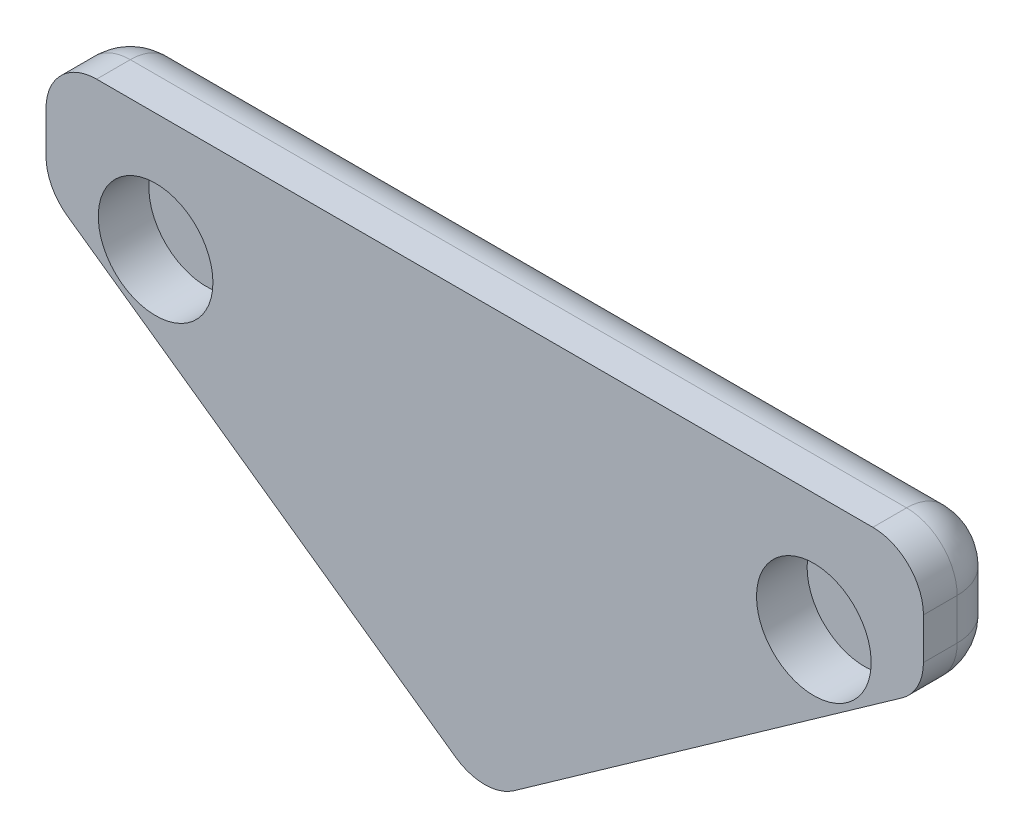
ISO-10303-21;
HEADER;
FILE_DESCRIPTION(('STEP AP214'),'2;1');
FILE_NAME('part.step','',(''),(''),'','','');
FILE_SCHEMA(('AUTOMOTIVE_DESIGN { 1 0 10303 214 1 1 1 1 }'));
ENDSEC;
DATA;
#1=APPLICATION_CONTEXT('core data for automotive mechanical design processes');
#2=APPLICATION_PROTOCOL_DEFINITION('international standard','automotive_design',2000,#1);
#3=PRODUCT_CONTEXT('',#1,'mechanical');
#4=PRODUCT('Part','Part','',(#3));
#5=PRODUCT_RELATED_PRODUCT_CATEGORY('part','',(#4));
#6=PRODUCT_DEFINITION_FORMATION('','',#4);
#7=PRODUCT_DEFINITION_CONTEXT('part definition',#1,'design');
#8=PRODUCT_DEFINITION('design','',#6,#7);
#9=PRODUCT_DEFINITION_SHAPE('','',#8);
#10=(LENGTH_UNIT() NAMED_UNIT(*) SI_UNIT(.MILLI.,.METRE.));
#11=(NAMED_UNIT(*) PLANE_ANGLE_UNIT() SI_UNIT($,.RADIAN.));
#12=(NAMED_UNIT(*) SI_UNIT($,.STERADIAN.) SOLID_ANGLE_UNIT());
#13=UNCERTAINTY_MEASURE_WITH_UNIT(LENGTH_MEASURE(1.E-05),#10,'distance_accuracy_value','');
#14=(GEOMETRIC_REPRESENTATION_CONTEXT(3) GLOBAL_UNCERTAINTY_ASSIGNED_CONTEXT((#13)) GLOBAL_UNIT_ASSIGNED_CONTEXT((#10,
#11,#12)) REPRESENTATION_CONTEXT('',''));
#15=CARTESIAN_POINT('',(0.,0.,0.));
#16=DIRECTION('',(0.,0.,1.));
#17=DIRECTION('',(1.,0.,0.));
#18=AXIS2_PLACEMENT_3D('',#15,#16,#17);
#19=CARTESIAN_POINT('',(5.44580381973494,12.7,2.5));
#20=DIRECTION('',(0.,-1.,0.));
#21=DIRECTION('',(1.,0.,0.));
#22=AXIS2_PLACEMENT_3D('',#19,#20,#21);
#23=PLANE('',#22);
#24=DIRECTION('',(-1.,0.,0.));
#25=VECTOR('',#24,1.);
#26=CARTESIAN_POINT('',(5.44580381973494,12.7,2.5));
#27=LINE('',#26,#25);
#28=CARTESIAN_POINT('',(16.9558038197349,12.7,2.5));
#29=VERTEX_POINT('',#28);
#30=CARTESIAN_POINT('',(-6.06419618026506,12.7,2.5));
#31=VERTEX_POINT('',#30);
#32=EDGE_CURVE('E293',#29,#31,#27,.T.);
#33=ORIENTED_EDGE('',*,*,#32,.F.);
#34=DIRECTION('',(0.,0.,-1.));
#35=VECTOR('',#34,1.);
#36=CARTESIAN_POINT('',(16.9558038197349,12.7,2.5));
#37=LINE('',#36,#35);
#38=CARTESIAN_POINT('',(16.9558038197349,12.7,1.5));
#39=VERTEX_POINT('',#38);
#40=EDGE_CURVE('E212',#29,#39,#37,.T.);
#41=ORIENTED_EDGE('',*,*,#40,.T.);
#42=DIRECTION('',(-1.,0.,0.));
#43=VECTOR('',#42,1.);
#44=CARTESIAN_POINT('',(5.44580381973494,12.7,1.5));
#45=LINE('',#44,#43);
#46=CARTESIAN_POINT('',(-6.06419618026506,12.7,1.5));
#47=VERTEX_POINT('',#46);
#48=EDGE_CURVE('E206',#39,#47,#45,.T.);
#49=ORIENTED_EDGE('',*,*,#48,.T.);
#50=DIRECTION('',(0.,0.,-1.));
#51=VECTOR('',#50,1.);
#52=CARTESIAN_POINT('',(-6.06419618026506,12.7,2.5));
#53=LINE('',#52,#51);
#54=EDGE_CURVE('E209',#47,#31,#53,.F.);
#55=ORIENTED_EDGE('',*,*,#54,.T.);
#56=EDGE_LOOP('',(#33,#41,#49,#55));
#57=FACE_BOUND('',#56,.T.);
#58=ADVANCED_FACE('F45',(#57),#23,.F.);
#59=CARTESIAN_POINT('',(-7.56419618026505,12.7,2.5));
#60=DIRECTION('',(1.,0.,0.));
#61=DIRECTION('',(0.,1.,0.));
#62=AXIS2_PLACEMENT_3D('',#59,#60,#61);
#63=PLANE('',#62);
#64=DIRECTION('',(0.,-1.,0.));
#65=VECTOR('',#64,1.);
#66=CARTESIAN_POINT('',(-7.56419618026505,12.7,1.5));
#67=LINE('',#66,#65);
#68=CARTESIAN_POINT('',(-7.56419618026506,11.2,1.5));
#69=VERTEX_POINT('',#68);
#70=CARTESIAN_POINT('',(-7.56419618026506,9.97643078407362,1.5));
#71=VERTEX_POINT('',#70);
#72=EDGE_CURVE('E55',#69,#71,#67,.T.);
#73=ORIENTED_EDGE('',*,*,#72,.T.);
#74=DIRECTION('',(0.,0.,-1.));
#75=VECTOR('',#74,1.);
#76=CARTESIAN_POINT('',(-7.56419618026506,9.97643078407362,2.5));
#77=LINE('',#76,#75);
#78=CARTESIAN_POINT('',(-7.56419618026506,9.97643078407362,2.5));
#79=VERTEX_POINT('',#78);
#80=EDGE_CURVE('E11',#71,#79,#77,.F.);
#81=ORIENTED_EDGE('',*,*,#80,.T.);
#82=DIRECTION('',(0.,-1.,0.));
#83=VECTOR('',#82,1.);
#84=CARTESIAN_POINT('',(-7.56419618026505,12.7,2.5));
#85=LINE('',#84,#83);
#86=CARTESIAN_POINT('',(-7.56419618026506,11.2,2.5));
#87=VERTEX_POINT('',#86);
#88=EDGE_CURVE('E300',#87,#79,#85,.T.);
#89=ORIENTED_EDGE('',*,*,#88,.F.);
#90=DIRECTION('',(0.,0.,-1.));
#91=VECTOR('',#90,1.);
#92=CARTESIAN_POINT('',(-7.56419618026506,11.2,2.5));
#93=LINE('',#92,#91);
#94=EDGE_CURVE('E66',#87,#69,#93,.T.);
#95=ORIENTED_EDGE('',*,*,#94,.T.);
#96=EDGE_LOOP('',(#73,#81,#89,#95));
#97=FACE_BOUND('',#96,.T.);
#98=ADVANCED_FACE('F325',(#97),#63,.F.);
#99=CARTESIAN_POINT('',(-7.56419618026506,9.19999999999999,2.5));
#100=DIRECTION('',(0.577372894319039,0.816480582075076,0.));
#101=DIRECTION('',(-0.816480582075076,0.577372894319039,0.));
#102=AXIS2_PLACEMENT_3D('',#99,#100,#101);
#103=PLANE('',#102);
#104=DIRECTION('',(0.816480582075076,-0.577372894319039,0.));
#105=VECTOR('',#104,1.);
#106=CARTESIAN_POINT('',(-7.56419618026506,9.19999999999999,1.5));
#107=LINE('',#106,#105);
#108=CARTESIAN_POINT('',(-6.93025552174362,8.751709910961,1.5));
#109=VERTEX_POINT('',#108);
#110=CARTESIAN_POINT('',(4.57974447825638,0.612432432098591,1.5));
#111=VERTEX_POINT('',#110);
#112=EDGE_CURVE('E314',#109,#111,#107,.T.);
#113=ORIENTED_EDGE('',*,*,#112,.T.);
#114=DIRECTION('',(0.,0.,-1.));
#115=VECTOR('',#114,1.);
#116=CARTESIAN_POINT('',(4.57974447825638,0.612432432098591,2.5));
#117=LINE('',#116,#115);
#118=CARTESIAN_POINT('',(4.57974447825638,0.612432432098591,2.5));
#119=VERTEX_POINT('',#118);
#120=EDGE_CURVE('E317',#111,#119,#117,.F.);
#121=ORIENTED_EDGE('',*,*,#120,.T.);
#122=DIRECTION('',(0.816480582075076,-0.577372894319039,0.));
#123=VECTOR('',#122,1.);
#124=CARTESIAN_POINT('',(-7.56419618026506,9.19999999999999,2.5));
#125=LINE('',#124,#123);
#126=CARTESIAN_POINT('',(-6.93025552174362,8.751709910961,2.5));
#127=VERTEX_POINT('',#126);
#128=EDGE_CURVE('E304',#127,#119,#125,.T.);
#129=ORIENTED_EDGE('',*,*,#128,.F.);
#130=DIRECTION('',(0.,0.,-1.));
#131=VECTOR('',#130,1.);
#132=CARTESIAN_POINT('',(-6.93025552174362,8.751709910961,2.5));
#133=LINE('',#132,#131);
#134=EDGE_CURVE('E311',#127,#109,#133,.T.);
#135=ORIENTED_EDGE('',*,*,#134,.T.);
#136=EDGE_LOOP('',(#113,#121,#129,#135));
#137=FACE_BOUND('',#136,.T.);
#138=ADVANCED_FACE('F345',(#137),#103,.F.);
#139=CARTESIAN_POINT('',(0.,0.,2.5));
#140=DIRECTION('',(0.,0.,1.));
#141=DIRECTION('',(1.,0.,0.));
#142=AXIS2_PLACEMENT_3D('',#139,#140,#141);
#143=PLANE('',#142);
#144=CARTESIAN_POINT('',(-4.31419618026505,9.2,2.5));
#145=DIRECTION('',(0.,0.,1.));
#146=DIRECTION('',(1.,0.,0.));
#147=AXIS2_PLACEMENT_3D('',#144,#145,#146);
#148=CIRCLE('',#147,1.7);
#149=CARTESIAN_POINT('',(-2.61419618026505,9.2,2.5));
#150=VERTEX_POINT('',#149);
#151=EDGE_CURVE('E163',#150,#150,#148,.T.);
#152=ORIENTED_EDGE('',*,*,#151,.F.);
#153=EDGE_LOOP('',(#152));
#154=FACE_BOUND('',#153,.T.);
#155=ORIENTED_EDGE('',*,*,#128,.T.);
#156=CARTESIAN_POINT('',(5.44580381973494,1.8371533052112,2.5));
#157=DIRECTION('',(0.,0.,1.));
#158=DIRECTION('',(1.,0.,0.));
#159=AXIS2_PLACEMENT_3D('',#156,#157,#158);
#160=CIRCLE('',#159,1.5);
#161=CARTESIAN_POINT('',(6.3118631612135,0.612432432098591,2.5));
#162=VERTEX_POINT('',#161);
#163=EDGE_CURVE('E161',#119,#162,#160,.T.);
#164=ORIENTED_EDGE('',*,*,#163,.T.);
#165=DIRECTION('',(-0.816480582075076,-0.577372894319039,0.));
#166=VECTOR('',#165,1.);
#167=CARTESIAN_POINT('',(18.4558038197349,9.19999999999999,2.5));
#168=LINE('',#167,#166);
#169=CARTESIAN_POINT('',(17.8218631612135,8.751709910961,2.5));
#170=VERTEX_POINT('',#169);
#171=EDGE_CURVE('E142',#170,#162,#168,.T.);
#172=ORIENTED_EDGE('',*,*,#171,.F.);
#173=CARTESIAN_POINT('',(16.9558038197349,9.97643078407362,2.5));
#174=DIRECTION('',(0.,0.,1.));
#175=DIRECTION('',(1.,0.,0.));
#176=AXIS2_PLACEMENT_3D('',#173,#174,#175);
#177=CIRCLE('',#176,1.5);
#178=CARTESIAN_POINT('',(18.4558038197349,9.97643078407362,2.5));
#179=VERTEX_POINT('',#178);
#180=EDGE_CURVE('E158',#170,#179,#177,.T.);
#181=ORIENTED_EDGE('',*,*,#180,.T.);
#182=DIRECTION('',(0.,-1.,0.));
#183=VECTOR('',#182,1.);
#184=CARTESIAN_POINT('',(18.4558038197349,12.7,2.5));
#185=LINE('',#184,#183);
#186=CARTESIAN_POINT('',(18.4558038197349,11.2,2.5));
#187=VERTEX_POINT('',#186);
#188=EDGE_CURVE('E164',#187,#179,#185,.T.);
#189=ORIENTED_EDGE('',*,*,#188,.F.);
#190=CARTESIAN_POINT('',(16.9558038197349,11.2,2.5));
#191=DIRECTION('',(0.,0.,1.));
#192=DIRECTION('',(1.,0.,0.));
#193=AXIS2_PLACEMENT_3D('',#190,#191,#192);
#194=CIRCLE('',#193,1.5);
#195=EDGE_CURVE('E170',#187,#29,#194,.T.);
#196=ORIENTED_EDGE('',*,*,#195,.T.);
#197=ORIENTED_EDGE('',*,*,#32,.T.);
#198=CARTESIAN_POINT('',(-6.06419618026506,11.2,2.5));
#199=DIRECTION('',(0.,0.,1.));
#200=DIRECTION('',(1.,0.,0.));
#201=AXIS2_PLACEMENT_3D('',#198,#199,#200);
#202=CIRCLE('',#201,1.5);
#203=EDGE_CURVE('E176',#31,#87,#202,.T.);
#204=ORIENTED_EDGE('',*,*,#203,.T.);
#205=ORIENTED_EDGE('',*,*,#88,.T.);
#206=CARTESIAN_POINT('',(-6.06419618026506,9.97643078407362,2.5));
#207=DIRECTION('',(0.,0.,1.));
#208=DIRECTION('',(1.,0.,0.));
#209=AXIS2_PLACEMENT_3D('',#206,#207,#208);
#210=CIRCLE('',#209,1.5);
#211=EDGE_CURVE('E171',#79,#127,#210,.T.);
#212=ORIENTED_EDGE('',*,*,#211,.T.);
#213=EDGE_LOOP('',(#155,#164,#172,#181,#189,#196,#197,#204,#205,#212));
#214=FACE_BOUND('',#213,.T.);
#215=CARTESIAN_POINT('',(15.2058038197349,9.2,2.5));
#216=DIRECTION('',(0.,0.,-1.));
#217=DIRECTION('',(-1.,0.,0.));
#218=AXIS2_PLACEMENT_3D('',#215,#216,#217);
#219=CIRCLE('',#218,1.7);
#220=CARTESIAN_POINT('',(13.5058038197349,9.2,2.5));
#221=VERTEX_POINT('',#220);
#222=EDGE_CURVE('E276',#221,#221,#219,.T.);
#223=ORIENTED_EDGE('',*,*,#222,.T.);
#224=EDGE_LOOP('',(#223));
#225=FACE_BOUND('',#224,.T.);
#226=ADVANCED_FACE('F155',(#154,#214,#225),#143,.T.);
#227=CARTESIAN_POINT('',(0.,0.,0.));
#228=DIRECTION('',(0.,0.,1.));
#229=DIRECTION('',(1.,0.,0.));
#230=AXIS2_PLACEMENT_3D('',#227,#228,#229);
#231=PLANE('',#230);
#232=DIRECTION('',(-1.,0.,0.));
#233=VECTOR('',#232,1.);
#234=CARTESIAN_POINT('',(0.,11.2,0.));
#235=LINE('',#234,#233);
#236=CARTESIAN_POINT('',(-6.06419618026506,11.2,0.));
#237=VERTEX_POINT('',#236);
#238=CARTESIAN_POINT('',(16.9558038197349,11.2,0.));
#239=VERTEX_POINT('',#238);
#240=EDGE_CURVE('E182',#237,#239,#235,.F.);
#241=ORIENTED_EDGE('',*,*,#240,.T.);
#242=DIRECTION('',(0.,-1.,0.));
#243=VECTOR('',#242,1.);
#244=CARTESIAN_POINT('',(16.955803819735,0.,0.));
#245=LINE('',#244,#243);
#246=CARTESIAN_POINT('',(16.9558038197349,9.97643078407362,0.));
#247=VERTEX_POINT('',#246);
#248=EDGE_CURVE('E194',#239,#247,#245,.T.);
#249=ORIENTED_EDGE('',*,*,#248,.T.);
#250=DIRECTION('',(-0.816480582075076,-0.577372894319039,0.));
#251=VECTOR('',#250,1.);
#252=CARTESIAN_POINT('',(0.949350874202201,-1.34250596449681,0.));
#253=LINE('',#252,#251);
#254=CARTESIAN_POINT('',(5.44580381973495,1.83715330521121,0.));
#255=VERTEX_POINT('',#254);
#256=EDGE_CURVE('E191',#247,#255,#253,.T.);
#257=ORIENTED_EDGE('',*,*,#256,.T.);
#258=DIRECTION('',(0.816480582075076,-0.577372894319039,0.));
#259=VECTOR('',#258,1.);
#260=CARTESIAN_POINT('',(2.68146955715931,3.79194771072203,0.));
#261=LINE('',#260,#259);
#262=CARTESIAN_POINT('',(-6.06419618026506,9.97643078407362,0.));
#263=VERTEX_POINT('',#262);
#264=EDGE_CURVE('E188',#255,#263,#261,.F.);
#265=ORIENTED_EDGE('',*,*,#264,.T.);
#266=DIRECTION('',(0.,-1.,0.));
#267=VECTOR('',#266,1.);
#268=CARTESIAN_POINT('',(-6.06419618026507,0.,0.));
#269=LINE('',#268,#267);
#270=EDGE_CURVE('E185',#263,#237,#269,.F.);
#271=ORIENTED_EDGE('',*,*,#270,.T.);
#272=EDGE_LOOP('',(#241,#249,#257,#265,#271));
#273=FACE_BOUND('',#272,.T.);
#274=ADVANCED_FACE('F365',(#273),#231,.F.);
#275=CARTESIAN_POINT('',(-4.31419618026505,9.2,1.));
#276=DIRECTION('',(0.,0.,1.));
#277=DIRECTION('',(1.,0.,0.));
#278=AXIS2_PLACEMENT_3D('',#275,#276,#277);
#279=CYLINDRICAL_SURFACE('',#278,1.7);
#280=CARTESIAN_POINT('',(-4.31419618026505,9.2,1.));
#281=DIRECTION('',(0.,0.,1.));
#282=DIRECTION('',(1.,0.,0.));
#283=AXIS2_PLACEMENT_3D('',#280,#281,#282);
#284=CIRCLE('',#283,1.7);
#285=CARTESIAN_POINT('',(-2.61419618026505,9.2,1.));
#286=VERTEX_POINT('',#285);
#287=EDGE_CURVE('E289',#286,#286,#284,.T.);
#288=ORIENTED_EDGE('',*,*,#287,.F.);
#289=EDGE_LOOP('',(#288));
#290=FACE_BOUND('',#289,.T.);
#291=ORIENTED_EDGE('',*,*,#151,.T.);
#292=EDGE_LOOP('',(#291));
#293=FACE_BOUND('',#292,.T.);
#294=ADVANCED_FACE('F579',(#290,#293),#279,.F.);
#295=CARTESIAN_POINT('',(-4.31419618026505,9.2,1.));
#296=DIRECTION('',(0.,0.,1.));
#297=DIRECTION('',(1.,0.,0.));
#298=AXIS2_PLACEMENT_3D('',#295,#296,#297);
#299=PLANE('',#298);
#300=ORIENTED_EDGE('',*,*,#287,.T.);
#301=EDGE_LOOP('',(#300));
#302=FACE_BOUND('',#301,.T.);
#303=ADVANCED_FACE('F566',(#302),#299,.T.);
#304=CARTESIAN_POINT('',(18.4558038197349,12.7,2.5));
#305=DIRECTION('',(-1.,0.,0.));
#306=DIRECTION('',(0.,1.,0.));
#307=AXIS2_PLACEMENT_3D('',#304,#305,#306);
#308=PLANE('',#307);
#309=DIRECTION('',(0.,-1.,0.));
#310=VECTOR('',#309,1.);
#311=CARTESIAN_POINT('',(18.4558038197349,12.7,1.5));
#312=LINE('',#311,#310);
#313=CARTESIAN_POINT('',(18.4558038197349,9.97643078407362,1.5));
#314=VERTEX_POINT('',#313);
#315=CARTESIAN_POINT('',(18.4558038197349,11.2,1.5));
#316=VERTEX_POINT('',#315);
#317=EDGE_CURVE('E200',#314,#316,#312,.F.);
#318=ORIENTED_EDGE('',*,*,#317,.T.);
#319=DIRECTION('',(0.,0.,-1.));
#320=VECTOR('',#319,1.);
#321=CARTESIAN_POINT('',(18.4558038197349,11.2,2.5));
#322=LINE('',#321,#320);
#323=EDGE_CURVE('E203',#316,#187,#322,.F.);
#324=ORIENTED_EDGE('',*,*,#323,.T.);
#325=ORIENTED_EDGE('',*,*,#188,.T.);
#326=DIRECTION('',(0.,0.,-1.));
#327=VECTOR('',#326,1.);
#328=CARTESIAN_POINT('',(18.4558038197349,9.97643078407362,2.5));
#329=LINE('',#328,#327);
#330=EDGE_CURVE('E168',#179,#314,#329,.T.);
#331=ORIENTED_EDGE('',*,*,#330,.T.);
#332=EDGE_LOOP('',(#318,#324,#325,#331));
#333=FACE_BOUND('',#332,.T.);
#334=ADVANCED_FACE('F553',(#333),#308,.F.);
#335=CARTESIAN_POINT('',(18.4558038197349,9.19999999999999,2.5));
#336=DIRECTION('',(-0.577372894319039,0.816480582075076,0.));
#337=DIRECTION('',(0.816480582075076,0.577372894319039,0.));
#338=AXIS2_PLACEMENT_3D('',#335,#336,#337);
#339=PLANE('',#338);
#340=ORIENTED_EDGE('',*,*,#171,.T.);
#341=DIRECTION('',(0.,0.,-1.));
#342=VECTOR('',#341,1.);
#343=CARTESIAN_POINT('',(6.3118631612135,0.612432432098591,2.5));
#344=LINE('',#343,#342);
#345=CARTESIAN_POINT('',(6.3118631612135,0.61243243209859,1.5));
#346=VERTEX_POINT('',#345);
#347=EDGE_CURVE('E151',#162,#346,#344,.T.);
#348=ORIENTED_EDGE('',*,*,#347,.T.);
#349=DIRECTION('',(-0.816480582075076,-0.577372894319039,0.));
#350=VECTOR('',#349,1.);
#351=CARTESIAN_POINT('',(18.4558038197349,9.19999999999999,1.5));
#352=LINE('',#351,#350);
#353=CARTESIAN_POINT('',(17.8218631612135,8.751709910961,1.5));
#354=VERTEX_POINT('',#353);
#355=EDGE_CURVE('E145',#346,#354,#352,.F.);
#356=ORIENTED_EDGE('',*,*,#355,.T.);
#357=DIRECTION('',(0.,0.,-1.));
#358=VECTOR('',#357,1.);
#359=CARTESIAN_POINT('',(17.8218631612135,8.751709910961,2.5));
#360=LINE('',#359,#358);
#361=EDGE_CURVE('E138',#354,#170,#360,.F.);
#362=ORIENTED_EDGE('',*,*,#361,.T.);
#363=EDGE_LOOP('',(#340,#348,#356,#362));
#364=FACE_BOUND('',#363,.T.);
#365=ADVANCED_FACE('F140',(#364),#339,.F.);
#366=CARTESIAN_POINT('',(15.2058038197349,9.2,1.));
#367=DIRECTION('',(0.,0.,1.));
#368=DIRECTION('',(-1.,0.,0.));
#369=AXIS2_PLACEMENT_3D('',#366,#367,#368);
#370=CYLINDRICAL_SURFACE('',#369,1.7);
#371=CARTESIAN_POINT('',(15.2058038197349,9.2,1.));
#372=DIRECTION('',(0.,0.,-1.));
#373=DIRECTION('',(-1.,0.,0.));
#374=AXIS2_PLACEMENT_3D('',#371,#372,#373);
#375=CIRCLE('',#374,1.7);
#376=CARTESIAN_POINT('',(13.5058038197349,9.2,1.));
#377=VERTEX_POINT('',#376);
#378=EDGE_CURVE('E280',#377,#377,#375,.T.);
#379=ORIENTED_EDGE('',*,*,#378,.T.);
#380=EDGE_LOOP('',(#379));
#381=FACE_BOUND('',#380,.T.);
#382=ORIENTED_EDGE('',*,*,#222,.F.);
#383=EDGE_LOOP('',(#382));
#384=FACE_BOUND('',#383,.T.);
#385=ADVANCED_FACE('F552',(#381,#384),#370,.F.);
#386=CARTESIAN_POINT('',(15.2058038197349,9.2,1.));
#387=DIRECTION('',(0.,0.,1.));
#388=DIRECTION('',(-1.,0.,0.));
#389=AXIS2_PLACEMENT_3D('',#386,#387,#388);
#390=PLANE('',#389);
#391=ORIENTED_EDGE('',*,*,#378,.F.);
#392=EDGE_LOOP('',(#391));
#393=FACE_BOUND('',#392,.T.);
#394=ADVANCED_FACE('F539',(#393),#390,.T.);
#395=CARTESIAN_POINT('',(16.9558038197349,11.2,2.5));
#396=DIRECTION('',(0.,0.,-1.));
#397=DIRECTION('',(-1.,0.,0.));
#398=AXIS2_PLACEMENT_3D('',#395,#396,#397);
#399=CYLINDRICAL_SURFACE('',#398,1.5);
#400=ORIENTED_EDGE('',*,*,#195,.F.);
#401=ORIENTED_EDGE('',*,*,#323,.F.);
#402=CARTESIAN_POINT('',(16.9558038197349,11.2,1.5));
#403=DIRECTION('',(0.,0.,-1.));
#404=DIRECTION('',(-1.,0.,0.));
#405=AXIS2_PLACEMENT_3D('',#402,#403,#404);
#406=CIRCLE('',#405,1.5);
#407=EDGE_CURVE('E49',#39,#316,#406,.T.);
#408=ORIENTED_EDGE('',*,*,#407,.F.);
#409=ORIENTED_EDGE('',*,*,#40,.F.);
#410=EDGE_LOOP('',(#400,#401,#408,#409));
#411=FACE_BOUND('',#410,.T.);
#412=ADVANCED_FACE('F47',(#411),#399,.T.);
#413=CARTESIAN_POINT('',(5.44580381973494,11.2,1.5));
#414=DIRECTION('',(-1.,0.,0.));
#415=DIRECTION('',(0.,-1.,0.));
#416=AXIS2_PLACEMENT_3D('',#413,#414,#415);
#417=CYLINDRICAL_SURFACE('',#416,1.5);
#418=CARTESIAN_POINT('',(-6.06419618026506,11.2,1.5));
#419=DIRECTION('',(-1.,0.,0.));
#420=DIRECTION('',(0.,0.,1.));
#421=AXIS2_PLACEMENT_3D('',#418,#419,#420);
#422=CIRCLE('',#421,1.5);
#423=EDGE_CURVE('E265',#47,#237,#422,.T.);
#424=ORIENTED_EDGE('',*,*,#423,.F.);
#425=ORIENTED_EDGE('',*,*,#48,.F.);
#426=CARTESIAN_POINT('',(16.9558038197349,11.2,1.5));
#427=DIRECTION('',(1.,0.,0.));
#428=DIRECTION('',(0.,1.,0.));
#429=AXIS2_PLACEMENT_3D('',#426,#427,#428);
#430=CIRCLE('',#429,1.5);
#431=EDGE_CURVE('E268',#239,#39,#430,.T.);
#432=ORIENTED_EDGE('',*,*,#431,.F.);
#433=ORIENTED_EDGE('',*,*,#240,.F.);
#434=EDGE_LOOP('',(#424,#425,#432,#433));
#435=FACE_BOUND('',#434,.T.);
#436=ADVANCED_FACE('F370',(#435),#417,.T.);
#437=CARTESIAN_POINT('',(-6.06419618026506,11.2,2.5));
#438=DIRECTION('',(0.,0.,-1.));
#439=DIRECTION('',(-1.,0.,0.));
#440=AXIS2_PLACEMENT_3D('',#437,#438,#439);
#441=CYLINDRICAL_SURFACE('',#440,1.5);
#442=ORIENTED_EDGE('',*,*,#203,.F.);
#443=ORIENTED_EDGE('',*,*,#54,.F.);
#444=CARTESIAN_POINT('',(-6.06419618026506,11.2,1.5));
#445=DIRECTION('',(0.,0.,-1.));
#446=DIRECTION('',(-1.,0.,0.));
#447=AXIS2_PLACEMENT_3D('',#444,#445,#446);
#448=CIRCLE('',#447,1.5);
#449=EDGE_CURVE('E261',#69,#47,#448,.T.);
#450=ORIENTED_EDGE('',*,*,#449,.F.);
#451=ORIENTED_EDGE('',*,*,#94,.F.);
#452=EDGE_LOOP('',(#442,#443,#450,#451));
#453=FACE_BOUND('',#452,.T.);
#454=ADVANCED_FACE('F326',(#453),#441,.T.);
#455=CARTESIAN_POINT('',(16.9558038197349,11.2,1.5));
#456=DIRECTION('',(0.,1.,0.));
#457=DIRECTION('',(-1.,0.,0.));
#458=AXIS2_PLACEMENT_3D('',#455,#456,#457);
#459=SPHERICAL_SURFACE('',#458,1.5);
#460=ORIENTED_EDGE('',*,*,#431,.T.);
#461=ORIENTED_EDGE('',*,*,#407,.T.);
#462=CARTESIAN_POINT('',(16.9558038197349,11.2,1.5));
#463=DIRECTION('',(0.,1.,0.));
#464=DIRECTION('',(-1.,0.,0.));
#465=AXIS2_PLACEMENT_3D('',#462,#463,#464);
#466=CIRCLE('',#465,1.5);
#467=EDGE_CURVE('E257',#239,#316,#466,.F.);
#468=ORIENTED_EDGE('',*,*,#467,.F.);
#469=EDGE_LOOP('',(#460,#461,#468));
#470=FACE_BOUND('',#469,.T.);
#471=ADVANCED_FACE('F371',(#470),#459,.T.);
#472=CARTESIAN_POINT('',(-6.06419618026506,11.2,1.5));
#473=DIRECTION('',(0.,1.,0.));
#474=DIRECTION('',(0.,0.,1.));
#475=AXIS2_PLACEMENT_3D('',#472,#473,#474);
#476=SPHERICAL_SURFACE('',#475,1.5);
#477=ORIENTED_EDGE('',*,*,#449,.T.);
#478=ORIENTED_EDGE('',*,*,#423,.T.);
#479=CARTESIAN_POINT('',(-6.06419618026506,11.2,1.5));
#480=DIRECTION('',(0.,1.,0.));
#481=DIRECTION('',(-1.,0.,0.));
#482=AXIS2_PLACEMENT_3D('',#479,#480,#481);
#483=CIRCLE('',#482,1.5);
#484=EDGE_CURVE('E253',#69,#237,#483,.F.);
#485=ORIENTED_EDGE('',*,*,#484,.F.);
#486=EDGE_LOOP('',(#477,#478,#485));
#487=FACE_BOUND('',#486,.T.);
#488=ADVANCED_FACE('F330',(#487),#476,.T.);
#489=CARTESIAN_POINT('',(16.9558038197349,9.97643078407362,2.5));
#490=DIRECTION('',(0.,0.,-1.));
#491=DIRECTION('',(-1.,0.,0.));
#492=AXIS2_PLACEMENT_3D('',#489,#490,#491);
#493=CYLINDRICAL_SURFACE('',#492,1.5);
#494=ORIENTED_EDGE('',*,*,#180,.F.);
#495=ORIENTED_EDGE('',*,*,#361,.F.);
#496=CARTESIAN_POINT('',(16.9558038197349,9.97643078407362,1.5));
#497=DIRECTION('',(0.,0.,-1.));
#498=DIRECTION('',(-1.,0.,0.));
#499=AXIS2_PLACEMENT_3D('',#496,#497,#498);
#500=CIRCLE('',#499,1.5);
#501=EDGE_CURVE('E250',#314,#354,#500,.T.);
#502=ORIENTED_EDGE('',*,*,#501,.F.);
#503=ORIENTED_EDGE('',*,*,#330,.F.);
#504=EDGE_LOOP('',(#494,#495,#502,#503));
#505=FACE_BOUND('',#504,.T.);
#506=ADVANCED_FACE('F167',(#505),#493,.T.);
#507=CARTESIAN_POINT('',(16.955803819735,0.,1.5));
#508=DIRECTION('',(0.,-1.,0.));
#509=DIRECTION('',(1.,0.,0.));
#510=AXIS2_PLACEMENT_3D('',#507,#508,#509);
#511=CYLINDRICAL_SURFACE('',#510,1.5);
#512=ORIENTED_EDGE('',*,*,#467,.T.);
#513=ORIENTED_EDGE('',*,*,#317,.F.);
#514=CARTESIAN_POINT('',(16.9558038197349,9.97643078407362,1.5));
#515=DIRECTION('',(0.,-1.,0.));
#516=DIRECTION('',(1.,0.,0.));
#517=AXIS2_PLACEMENT_3D('',#514,#515,#516);
#518=CIRCLE('',#517,1.5);
#519=EDGE_CURVE('E246',#247,#314,#518,.T.);
#520=ORIENTED_EDGE('',*,*,#519,.F.);
#521=ORIENTED_EDGE('',*,*,#248,.F.);
#522=EDGE_LOOP('',(#512,#513,#520,#521));
#523=FACE_BOUND('',#522,.T.);
#524=ADVANCED_FACE('F363',(#523),#511,.T.);
#525=CARTESIAN_POINT('',(-6.06419618026505,12.7,1.5));
#526=DIRECTION('',(0.,-1.,0.));
#527=DIRECTION('',(1.,0.,0.));
#528=AXIS2_PLACEMENT_3D('',#525,#526,#527);
#529=CYLINDRICAL_SURFACE('',#528,1.5);
#530=ORIENTED_EDGE('',*,*,#484,.T.);
#531=ORIENTED_EDGE('',*,*,#270,.F.);
#532=CARTESIAN_POINT('',(-6.06419618026506,9.97643078407362,1.5));
#533=DIRECTION('',(0.,-1.,0.));
#534=DIRECTION('',(1.,0.,0.));
#535=AXIS2_PLACEMENT_3D('',#532,#533,#534);
#536=CIRCLE('',#535,1.5);
#537=EDGE_CURVE('E242',#71,#263,#536,.T.);
#538=ORIENTED_EDGE('',*,*,#537,.F.);
#539=ORIENTED_EDGE('',*,*,#72,.F.);
#540=EDGE_LOOP('',(#530,#531,#538,#539));
#541=FACE_BOUND('',#540,.T.);
#542=ADVANCED_FACE('F334',(#541),#529,.T.);
#543=CARTESIAN_POINT('',(-6.06419618026506,9.97643078407362,2.5));
#544=DIRECTION('',(0.,0.,-1.));
#545=DIRECTION('',(-1.,0.,0.));
#546=AXIS2_PLACEMENT_3D('',#543,#544,#545);
#547=CYLINDRICAL_SURFACE('',#546,1.5);
#548=ORIENTED_EDGE('',*,*,#211,.F.);
#549=ORIENTED_EDGE('',*,*,#80,.F.);
#550=CARTESIAN_POINT('',(-6.06419618026506,9.97643078407362,1.5));
#551=DIRECTION('',(0.,0.,-1.));
#552=DIRECTION('',(-1.,0.,0.));
#553=AXIS2_PLACEMENT_3D('',#550,#551,#552);
#554=CIRCLE('',#553,1.5);
#555=EDGE_CURVE('E238',#109,#71,#554,.T.);
#556=ORIENTED_EDGE('',*,*,#555,.F.);
#557=ORIENTED_EDGE('',*,*,#134,.F.);
#558=EDGE_LOOP('',(#548,#549,#556,#557));
#559=FACE_BOUND('',#558,.T.);
#560=ADVANCED_FACE('F342',(#559),#547,.T.);
#561=CARTESIAN_POINT('',(16.9558038197349,9.97643078407362,1.5));
#562=DIRECTION('',(0.,0.,-1.));
#563=DIRECTION('',(-1.,0.,0.));
#564=AXIS2_PLACEMENT_3D('',#561,#562,#563);
#565=SPHERICAL_SURFACE('',#564,1.5);
#566=ORIENTED_EDGE('',*,*,#519,.T.);
#567=ORIENTED_EDGE('',*,*,#501,.T.);
#568=CARTESIAN_POINT('',(16.9558038197349,9.97643078407362,1.5));
#569=DIRECTION('',(0.816480582075076,0.577372894319039,0.));
#570=DIRECTION('',(-0.577372894319039,0.816480582075076,0.));
#571=AXIS2_PLACEMENT_3D('',#568,#569,#570);
#572=CIRCLE('',#571,1.5);
#573=EDGE_CURVE('E234',#247,#354,#572,.F.);
#574=ORIENTED_EDGE('',*,*,#573,.F.);
#575=EDGE_LOOP('',(#566,#567,#574));
#576=FACE_BOUND('',#575,.T.);
#577=ADVANCED_FACE('F359',(#576),#565,.T.);
#578=CARTESIAN_POINT('',(-6.06419618026506,9.97643078407362,1.5));
#579=DIRECTION('',(0.,0.,-1.));
#580=DIRECTION('',(-1.,0.,0.));
#581=AXIS2_PLACEMENT_3D('',#578,#579,#580);
#582=SPHERICAL_SURFACE('',#581,1.5);
#583=ORIENTED_EDGE('',*,*,#555,.T.);
#584=ORIENTED_EDGE('',*,*,#537,.T.);
#585=CARTESIAN_POINT('',(-6.06419618026506,9.97643078407362,1.5));
#586=DIRECTION('',(-0.816480582075076,0.577372894319039,0.));
#587=DIRECTION('',(-0.577372894319039,-0.816480582075076,0.));
#588=AXIS2_PLACEMENT_3D('',#585,#586,#587);
#589=CIRCLE('',#588,1.5);
#590=EDGE_CURVE('E230',#109,#263,#589,.F.);
#591=ORIENTED_EDGE('',*,*,#590,.F.);
#592=EDGE_LOOP('',(#583,#584,#591));
#593=FACE_BOUND('',#592,.T.);
#594=ADVANCED_FACE('F338',(#593),#582,.T.);
#595=CARTESIAN_POINT('',(0.949350874202201,-1.34250596449681,1.5));
#596=DIRECTION('',(-0.816480582075076,-0.577372894319039,0.));
#597=DIRECTION('',(0.577372894319039,-0.816480582075076,0.));
#598=AXIS2_PLACEMENT_3D('',#595,#596,#597);
#599=CYLINDRICAL_SURFACE('',#598,1.5);
#600=ORIENTED_EDGE('',*,*,#573,.T.);
#601=ORIENTED_EDGE('',*,*,#355,.F.);
#602=CARTESIAN_POINT('',(5.44580381973495,1.83715330521121,1.5));
#603=DIRECTION('',(-0.816480582075078,-0.577372894319037,0.));
#604=DIRECTION('',(0.577372894319037,-0.816480582075078,0.));
#605=AXIS2_PLACEMENT_3D('',#602,#603,#604);
#606=CIRCLE('',#605,1.5);
#607=EDGE_CURVE('E226',#255,#346,#606,.T.);
#608=ORIENTED_EDGE('',*,*,#607,.F.);
#609=ORIENTED_EDGE('',*,*,#256,.F.);
#610=EDGE_LOOP('',(#600,#601,#608,#609));
#611=FACE_BOUND('',#610,.T.);
#612=ADVANCED_FACE('F355',(#611),#599,.T.);
#613=CARTESIAN_POINT('',(-6.6981368387865,10.4247208731126,1.5));
#614=DIRECTION('',(0.816480582075076,-0.577372894319039,0.));
#615=DIRECTION('',(0.577372894319039,0.816480582075076,0.));
#616=AXIS2_PLACEMENT_3D('',#613,#614,#615);
#617=CYLINDRICAL_SURFACE('',#616,1.5);
#618=ORIENTED_EDGE('',*,*,#590,.T.);
#619=ORIENTED_EDGE('',*,*,#264,.F.);
#620=CARTESIAN_POINT('',(5.44580381973494,1.83715330521121,1.5));
#621=DIRECTION('',(0.816480582075076,-0.577372894319039,0.));
#622=DIRECTION('',(0.577372894319039,0.816480582075076,0.));
#623=AXIS2_PLACEMENT_3D('',#620,#621,#622);
#624=CIRCLE('',#623,1.5);
#625=EDGE_CURVE('E222',#111,#255,#624,.T.);
#626=ORIENTED_EDGE('',*,*,#625,.F.);
#627=ORIENTED_EDGE('',*,*,#112,.F.);
#628=EDGE_LOOP('',(#618,#619,#626,#627));
#629=FACE_BOUND('',#628,.T.);
#630=ADVANCED_FACE('F393',(#629),#617,.T.);
#631=CARTESIAN_POINT('',(5.44580381973495,1.8371533052112,1.5));
#632=DIRECTION('',(0.,0.,-1.));
#633=DIRECTION('',(0.,1.,0.));
#634=AXIS2_PLACEMENT_3D('',#631,#632,#633);
#635=SPHERICAL_SURFACE('',#634,1.5);
#636=ORIENTED_EDGE('',*,*,#625,.T.);
#637=ORIENTED_EDGE('',*,*,#607,.T.);
#638=CARTESIAN_POINT('',(5.44580381973494,1.83715330521121,1.5));
#639=DIRECTION('',(0.,0.,-1.));
#640=DIRECTION('',(-1.,0.,0.));
#641=AXIS2_PLACEMENT_3D('',#638,#639,#640);
#642=CIRCLE('',#641,1.5);
#643=EDGE_CURVE('E219',#111,#346,#642,.F.);
#644=ORIENTED_EDGE('',*,*,#643,.F.);
#645=EDGE_LOOP('',(#636,#637,#644));
#646=FACE_BOUND('',#645,.T.);
#647=ADVANCED_FACE('F352',(#646),#635,.T.);
#648=CARTESIAN_POINT('',(5.44580381973494,1.8371533052112,2.5));
#649=DIRECTION('',(0.,0.,-1.));
#650=DIRECTION('',(-1.,0.,0.));
#651=AXIS2_PLACEMENT_3D('',#648,#649,#650);
#652=CYLINDRICAL_SURFACE('',#651,1.5);
#653=ORIENTED_EDGE('',*,*,#163,.F.);
#654=ORIENTED_EDGE('',*,*,#120,.F.);
#655=ORIENTED_EDGE('',*,*,#643,.T.);
#656=ORIENTED_EDGE('',*,*,#347,.F.);
#657=EDGE_LOOP('',(#653,#654,#655,#656));
#658=FACE_BOUND('',#657,.T.);
#659=ADVANCED_FACE('F350',(#658),#652,.T.);
#660=CLOSED_SHELL('',(#58,#98,#138,#226,#274,#294,#303,#334,#365,#385,#394,#412,#436,#454,#471,
#488,#506,#524,#542,#560,#577,#594,#612,#630,#647,#659));
#661=MANIFOLD_SOLID_BREP('B2',#660);
#662=ADVANCED_BREP_SHAPE_REPRESENTATION('',(#18,#661),#14);
#663=SHAPE_DEFINITION_REPRESENTATION(#9,#662);
ENDSEC;
END-ISO-10303-21;
